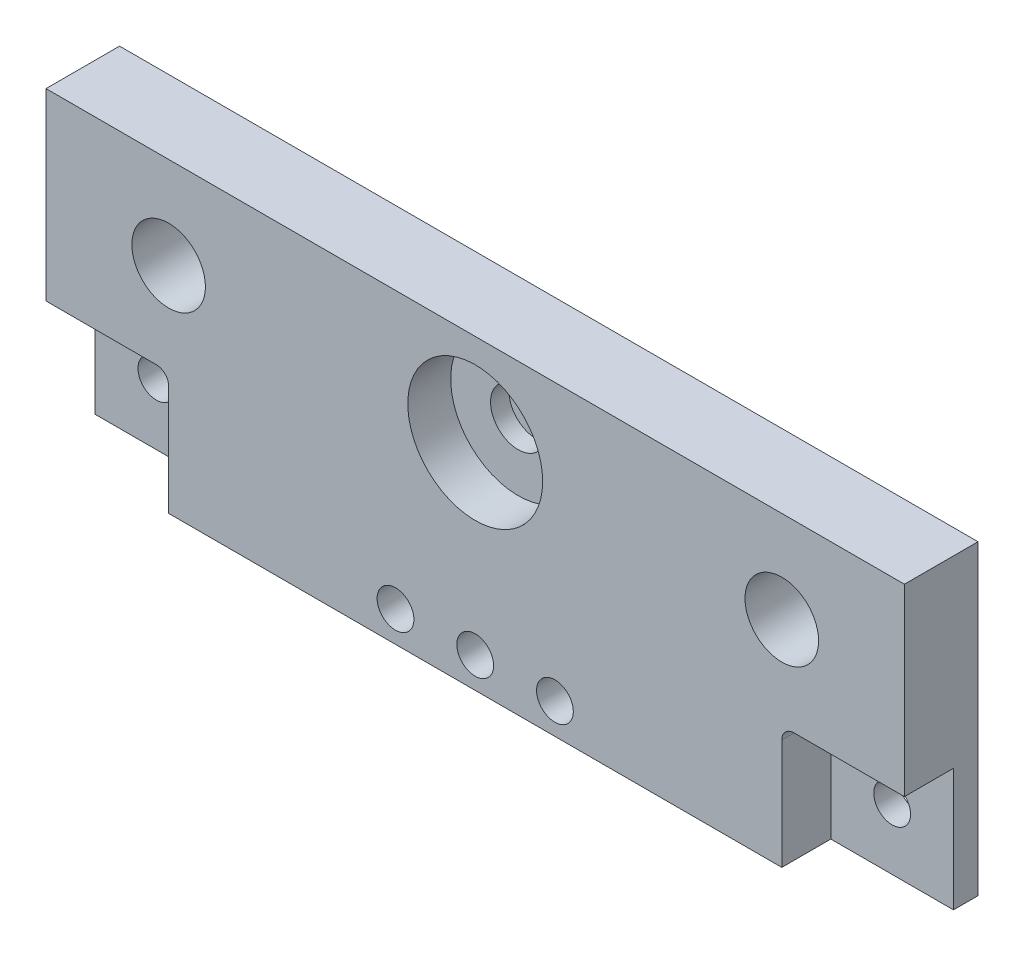
ISO-10303-21;
HEADER;
FILE_DESCRIPTION(('STEP AP214'),'2;1');
FILE_NAME('part.step','',(''),(''),'','','');
FILE_SCHEMA(('AUTOMOTIVE_DESIGN { 1 0 10303 214 1 1 1 1 }'));
ENDSEC;
DATA;
#1=APPLICATION_CONTEXT('core data for automotive mechanical design processes');
#2=APPLICATION_PROTOCOL_DEFINITION('international standard','automotive_design',2000,#1);
#3=PRODUCT_CONTEXT('',#1,'mechanical');
#4=PRODUCT('Part','Part','',(#3));
#5=PRODUCT_RELATED_PRODUCT_CATEGORY('part','',(#4));
#6=PRODUCT_DEFINITION_FORMATION('','',#4);
#7=PRODUCT_DEFINITION_CONTEXT('part definition',#1,'design');
#8=PRODUCT_DEFINITION('design','',#6,#7);
#9=PRODUCT_DEFINITION_SHAPE('','',#8);
#10=(LENGTH_UNIT() NAMED_UNIT(*) SI_UNIT(.MILLI.,.METRE.));
#11=(NAMED_UNIT(*) PLANE_ANGLE_UNIT() SI_UNIT($,.RADIAN.));
#12=(NAMED_UNIT(*) SI_UNIT($,.STERADIAN.) SOLID_ANGLE_UNIT());
#13=UNCERTAINTY_MEASURE_WITH_UNIT(LENGTH_MEASURE(1.E-05),#10,'distance_accuracy_value','');
#14=(GEOMETRIC_REPRESENTATION_CONTEXT(3) GLOBAL_UNCERTAINTY_ASSIGNED_CONTEXT((#13)) GLOBAL_UNIT_ASSIGNED_CONTEXT((#10,
#11,#12)) REPRESENTATION_CONTEXT('',''));
#15=CARTESIAN_POINT('',(0.,0.,0.));
#16=DIRECTION('',(0.,0.,1.));
#17=DIRECTION('',(1.,0.,0.));
#18=AXIS2_PLACEMENT_3D('',#15,#16,#17);
#19=CARTESIAN_POINT('',(-60.0436585898276,-43.0813250382013,8.));
#20=DIRECTION('',(0.,1.,0.));
#21=DIRECTION('',(0.,0.,1.));
#22=AXIS2_PLACEMENT_3D('',#19,#20,#21);
#23=PLANE('',#22);
#24=DIRECTION('',(1.,0.,0.));
#25=VECTOR('',#24,1.);
#26=CARTESIAN_POINT('',(-60.0436585898276,-43.0813250382013,0.));
#27=LINE('',#26,#25);
#28=CARTESIAN_POINT('',(-60.0436585898276,-43.0813250382013,0.));
#29=VERTEX_POINT('',#28);
#30=CARTESIAN_POINT('',(-42.0436585898276,-43.0813250382013,0.));
#31=VERTEX_POINT('',#30);
#32=EDGE_CURVE('E217',#29,#31,#27,.T.);
#33=ORIENTED_EDGE('',*,*,#32,.T.);
#34=DIRECTION('',(0.,0.,-1.));
#35=VECTOR('',#34,1.);
#36=CARTESIAN_POINT('',(-42.0436585898276,-43.0813250382013,8.));
#37=LINE('',#36,#35);
#38=CARTESIAN_POINT('',(-42.0436585898276,-43.0813250382013,8.));
#39=VERTEX_POINT('',#38);
#40=EDGE_CURVE('E241',#31,#39,#37,.F.);
#41=ORIENTED_EDGE('',*,*,#40,.T.);
#42=DIRECTION('',(1.,0.,0.));
#43=VECTOR('',#42,1.);
#44=CARTESIAN_POINT('',(-60.0436585898276,-43.0813250382013,8.));
#45=LINE('',#44,#43);
#46=CARTESIAN_POINT('',(-60.0436585898276,-43.0813250382013,8.));
#47=VERTEX_POINT('',#46);
#48=EDGE_CURVE('E218',#47,#39,#45,.T.);
#49=ORIENTED_EDGE('',*,*,#48,.F.);
#50=DIRECTION('',(0.,0.,-1.));
#51=VECTOR('',#50,1.);
#52=CARTESIAN_POINT('',(-60.0436585898276,-43.0813250382013,8.));
#53=LINE('',#52,#51);
#54=EDGE_CURVE('E256',#47,#29,#53,.T.);
#55=ORIENTED_EDGE('',*,*,#54,.T.);
#56=EDGE_LOOP('',(#33,#41,#49,#55));
#57=FACE_BOUND('',#56,.T.);
#58=ADVANCED_FACE('F34',(#57),#23,.F.);
#59=CARTESIAN_POINT('',(61.9563414101724,-43.0813250382013,8.));
#60=VERTEX_POINT('',#59);
#61=CARTESIAN_POINT('',(79.9563414101724,-43.0813250382013,8.));
#62=VERTEX_POINT('',#61);
#63=EDGE_CURVE('E216',#60,#62,#45,.T.);
#64=ORIENTED_EDGE('',*,*,#63,.F.);
#65=DIRECTION('',(0.,0.,-1.));
#66=VECTOR('',#65,1.);
#67=CARTESIAN_POINT('',(61.9563414101724,-43.0813250382013,0.));
#68=LINE('',#67,#66);
#69=CARTESIAN_POINT('',(61.9563414101724,-43.0813250382013,0.));
#70=VERTEX_POINT('',#69);
#71=EDGE_CURVE('E235',#60,#70,#68,.T.);
#72=ORIENTED_EDGE('',*,*,#71,.T.);
#73=CARTESIAN_POINT('',(79.9563414101724,-43.0813250382013,0.));
#74=VERTEX_POINT('',#73);
#75=EDGE_CURVE('E211',#70,#74,#27,.T.);
#76=ORIENTED_EDGE('',*,*,#75,.T.);
#77=DIRECTION('',(0.,0.,-1.));
#78=VECTOR('',#77,1.);
#79=CARTESIAN_POINT('',(79.9563414101724,-43.0813250382013,8.));
#80=LINE('',#79,#78);
#81=EDGE_CURVE('E261',#62,#74,#80,.T.);
#82=ORIENTED_EDGE('',*,*,#81,.F.);
#83=EDGE_LOOP('',(#64,#72,#76,#82));
#84=FACE_BOUND('',#83,.T.);
#85=ADVANCED_FACE('F294',(#84),#23,.F.);
#86=CARTESIAN_POINT('',(0.,0.,0.));
#87=DIRECTION('',(0.,0.,-1.));
#88=DIRECTION('',(-1.,0.,0.));
#89=AXIS2_PLACEMENT_3D('',#86,#87,#88);
#90=PLANE('',#89);
#91=CARTESIAN_POINT('',(-50.0436585898276,-53.0813250382013,0.));
#92=DIRECTION('',(0.,0.,-1.));
#93=DIRECTION('',(-1.,0.,0.));
#94=AXIS2_PLACEMENT_3D('',#91,#92,#93);
#95=CIRCLE('',#94,3.);
#96=CARTESIAN_POINT('',(-53.0436585898276,-53.0813250382013,0.));
#97=VERTEX_POINT('',#96);
#98=EDGE_CURVE('E153',#97,#97,#95,.T.);
#99=ORIENTED_EDGE('',*,*,#98,.T.);
#100=EDGE_LOOP('',(#99));
#101=FACE_BOUND('',#100,.T.);
#102=DIRECTION('',(0.,-1.,0.));
#103=VECTOR('',#102,1.);
#104=CARTESIAN_POINT('',(-40.0436585898276,-43.0813250382013,0.));
#105=LINE('',#104,#103);
#106=CARTESIAN_POINT('',(-40.0436585898276,-45.0813250382013,0.));
#107=VERTEX_POINT('',#106);
#108=CARTESIAN_POINT('',(-40.0436585898276,-63.0813250382013,0.));
#109=VERTEX_POINT('',#108);
#110=EDGE_CURVE('E149',#107,#109,#105,.T.);
#111=ORIENTED_EDGE('',*,*,#110,.F.);
#112=CARTESIAN_POINT('',(-42.0436585898276,-45.0813250382013,0.));
#113=DIRECTION('',(0.,0.,-1.));
#114=DIRECTION('',(-1.,0.,0.));
#115=AXIS2_PLACEMENT_3D('',#112,#113,#114);
#116=CIRCLE('',#115,2.);
#117=EDGE_CURVE('E242',#107,#31,#116,.F.);
#118=ORIENTED_EDGE('',*,*,#117,.T.);
#119=ORIENTED_EDGE('',*,*,#32,.F.);
#120=DIRECTION('',(0.,1.,0.));
#121=VECTOR('',#120,1.);
#122=CARTESIAN_POINT('',(-60.0436585898276,-13.0813250382013,0.));
#123=LINE('',#122,#121);
#124=CARTESIAN_POINT('',(-60.0436585898276,-63.0813250382013,0.));
#125=VERTEX_POINT('',#124);
#126=EDGE_CURVE('E171',#125,#29,#123,.T.);
#127=ORIENTED_EDGE('',*,*,#126,.F.);
#128=DIRECTION('',(-1.,0.,0.));
#129=VECTOR('',#128,1.);
#130=CARTESIAN_POINT('',(79.9563414101724,-63.0813250382013,0.));
#131=LINE('',#130,#129);
#132=EDGE_CURVE('E187',#109,#125,#131,.T.);
#133=ORIENTED_EDGE('',*,*,#132,.F.);
#134=EDGE_LOOP('',(#111,#118,#119,#127,#133));
#135=FACE_BOUND('',#134,.T.);
#136=ADVANCED_FACE('F301',(#101,#135),#90,.F.);
#137=CARTESIAN_POINT('',(69.9563414101724,-53.0813250382013,0.));
#138=DIRECTION('',(0.,0.,-1.));
#139=DIRECTION('',(-1.,0.,0.));
#140=AXIS2_PLACEMENT_3D('',#137,#138,#139);
#141=CIRCLE('',#140,3.00000000000001);
#142=CARTESIAN_POINT('',(66.9563414101724,-53.0813250382013,0.));
#143=VERTEX_POINT('',#142);
#144=EDGE_CURVE('E163',#143,#143,#141,.T.);
#145=ORIENTED_EDGE('',*,*,#144,.T.);
#146=EDGE_LOOP('',(#145));
#147=FACE_BOUND('',#146,.T.);
#148=ORIENTED_EDGE('',*,*,#75,.F.);
#149=CARTESIAN_POINT('',(61.9563414101724,-45.0813250382013,0.));
#150=DIRECTION('',(0.,0.,-1.));
#151=DIRECTION('',(-1.,0.,0.));
#152=AXIS2_PLACEMENT_3D('',#149,#150,#151);
#153=CIRCLE('',#152,2.);
#154=CARTESIAN_POINT('',(59.9563414101724,-45.0813250382013,0.));
#155=VERTEX_POINT('',#154);
#156=EDGE_CURVE('E56',#70,#155,#153,.F.);
#157=ORIENTED_EDGE('',*,*,#156,.T.);
#158=DIRECTION('',(0.,1.,0.));
#159=VECTOR('',#158,1.);
#160=CARTESIAN_POINT('',(59.9563414101724,-43.0813250382013,0.));
#161=LINE('',#160,#159);
#162=CARTESIAN_POINT('',(59.9563414101724,-63.0813250382013,0.));
#163=VERTEX_POINT('',#162);
#164=EDGE_CURVE('E136',#163,#155,#161,.T.);
#165=ORIENTED_EDGE('',*,*,#164,.F.);
#166=CARTESIAN_POINT('',(79.9563414101724,-63.0813250382013,0.));
#167=VERTEX_POINT('',#166);
#168=EDGE_CURVE('E182',#167,#163,#131,.T.);
#169=ORIENTED_EDGE('',*,*,#168,.F.);
#170=DIRECTION('',(0.,-1.,0.));
#171=VECTOR('',#170,1.);
#172=CARTESIAN_POINT('',(79.9563414101724,-13.0813250382013,0.));
#173=LINE('',#172,#171);
#174=EDGE_CURVE('E166',#74,#167,#173,.T.);
#175=ORIENTED_EDGE('',*,*,#174,.F.);
#176=EDGE_LOOP('',(#148,#157,#165,#169,#175));
#177=FACE_BOUND('',#176,.T.);
#178=ADVANCED_FACE('F354',(#147,#177),#90,.F.);
#179=CARTESIAN_POINT('',(-60.0436585898276,-43.0813250382013,8.));
#180=DIRECTION('',(0.,0.,1.));
#181=DIRECTION('',(1.,0.,0.));
#182=AXIS2_PLACEMENT_3D('',#179,#180,#181);
#183=PLANE('',#182);
#184=CARTESIAN_POINT('',(9.95634141017243,-58.0813250382013,8.));
#185=DIRECTION('',(0.,0.,1.));
#186=DIRECTION('',(1.,0.,0.));
#187=AXIS2_PLACEMENT_3D('',#184,#185,#186);
#188=CIRCLE('',#187,3.);
#189=CARTESIAN_POINT('',(12.9563414101724,-58.0813250382013,8.));
#190=VERTEX_POINT('',#189);
#191=EDGE_CURVE('E342',#190,#190,#188,.T.);
#192=ORIENTED_EDGE('',*,*,#191,.F.);
#193=EDGE_LOOP('',(#192));
#194=FACE_BOUND('',#193,.T.);
#195=CARTESIAN_POINT('',(-3.04365858982756,-58.0813250382013,8.));
#196=DIRECTION('',(0.,0.,1.));
#197=DIRECTION('',(1.,0.,0.));
#198=AXIS2_PLACEMENT_3D('',#195,#196,#197);
#199=CIRCLE('',#198,3.);
#200=CARTESIAN_POINT('',(-0.0436585898275521,-58.0813250382013,8.));
#201=VERTEX_POINT('',#200);
#202=EDGE_CURVE('E327',#201,#201,#199,.T.);
#203=ORIENTED_EDGE('',*,*,#202,.F.);
#204=EDGE_LOOP('',(#203));
#205=FACE_BOUND('',#204,.T.);
#206=CARTESIAN_POINT('',(22.9563414101724,-58.0813250382013,8.));
#207=DIRECTION('',(0.,0.,1.));
#208=DIRECTION('',(1.,0.,0.));
#209=AXIS2_PLACEMENT_3D('',#206,#207,#208);
#210=CIRCLE('',#209,3.);
#211=CARTESIAN_POINT('',(25.9563414101724,-58.0813250382013,8.));
#212=VERTEX_POINT('',#211);
#213=EDGE_CURVE('E320',#212,#212,#210,.T.);
#214=ORIENTED_EDGE('',*,*,#213,.F.);
#215=EDGE_LOOP('',(#214));
#216=FACE_BOUND('',#215,.T.);
#217=CARTESIAN_POINT('',(-40.0436585898276,-28.0813250382013,8.));
#218=DIRECTION('',(0.,0.,1.));
#219=DIRECTION('',(1.,0.,0.));
#220=AXIS2_PLACEMENT_3D('',#217,#218,#219);
#221=CIRCLE('',#220,6.);
#222=CARTESIAN_POINT('',(-34.0436585898276,-28.0813250382013,8.));
#223=VERTEX_POINT('',#222);
#224=EDGE_CURVE('E203',#223,#223,#221,.T.);
#225=ORIENTED_EDGE('',*,*,#224,.F.);
#226=EDGE_LOOP('',(#225));
#227=FACE_BOUND('',#226,.T.);
#228=DIRECTION('',(0.,-1.,0.));
#229=VECTOR('',#228,1.);
#230=CARTESIAN_POINT('',(-60.0436585898276,-13.0813250382013,8.));
#231=LINE('',#230,#229);
#232=CARTESIAN_POINT('',(-60.0436585898276,-13.0813250382013,8.));
#233=VERTEX_POINT('',#232);
#234=EDGE_CURVE('E214',#233,#47,#231,.T.);
#235=ORIENTED_EDGE('',*,*,#234,.T.);
#236=ORIENTED_EDGE('',*,*,#48,.T.);
#237=CARTESIAN_POINT('',(-42.0436585898276,-45.0813250382013,8.));
#238=DIRECTION('',(0.,0.,1.));
#239=DIRECTION('',(1.,0.,0.));
#240=AXIS2_PLACEMENT_3D('',#237,#238,#239);
#241=CIRCLE('',#240,2.);
#242=CARTESIAN_POINT('',(-40.0436585898276,-45.0813250382013,8.));
#243=VERTEX_POINT('',#242);
#244=EDGE_CURVE('E131',#39,#243,#241,.F.);
#245=ORIENTED_EDGE('',*,*,#244,.T.);
#246=DIRECTION('',(0.,-1.,0.));
#247=VECTOR('',#246,1.);
#248=CARTESIAN_POINT('',(-40.0436585898276,-43.0813250382013,8.));
#249=LINE('',#248,#247);
#250=CARTESIAN_POINT('',(-40.0436585898276,-63.0813250382013,8.));
#251=VERTEX_POINT('',#250);
#252=EDGE_CURVE('E122',#243,#251,#249,.T.);
#253=ORIENTED_EDGE('',*,*,#252,.T.);
#254=DIRECTION('',(1.,0.,0.));
#255=VECTOR('',#254,1.);
#256=CARTESIAN_POINT('',(-40.0436585898276,-63.0813250382013,8.));
#257=LINE('',#256,#255);
#258=CARTESIAN_POINT('',(59.9563414101724,-63.0813250382013,8.));
#259=VERTEX_POINT('',#258);
#260=EDGE_CURVE('E127',#251,#259,#257,.T.);
#261=ORIENTED_EDGE('',*,*,#260,.T.);
#262=DIRECTION('',(0.,1.,0.));
#263=VECTOR('',#262,1.);
#264=CARTESIAN_POINT('',(59.9563414101724,-43.0813250382013,8.));
#265=LINE('',#264,#263);
#266=CARTESIAN_POINT('',(59.9563414101724,-45.0813250382013,8.));
#267=VERTEX_POINT('',#266);
#268=EDGE_CURVE('E145',#259,#267,#265,.T.);
#269=ORIENTED_EDGE('',*,*,#268,.T.);
#270=CARTESIAN_POINT('',(61.9563414101724,-45.0813250382013,8.));
#271=DIRECTION('',(0.,0.,1.));
#272=DIRECTION('',(1.,0.,0.));
#273=AXIS2_PLACEMENT_3D('',#270,#271,#272);
#274=CIRCLE('',#273,2.);
#275=EDGE_CURVE('E11',#267,#60,#274,.F.);
#276=ORIENTED_EDGE('',*,*,#275,.T.);
#277=ORIENTED_EDGE('',*,*,#63,.T.);
#278=DIRECTION('',(0.,1.,0.));
#279=VECTOR('',#278,1.);
#280=CARTESIAN_POINT('',(79.9563414101724,-13.0813250382013,8.));
#281=LINE('',#280,#279);
#282=CARTESIAN_POINT('',(79.9563414101724,-13.0813250382013,8.));
#283=VERTEX_POINT('',#282);
#284=EDGE_CURVE('E220',#62,#283,#281,.T.);
#285=ORIENTED_EDGE('',*,*,#284,.T.);
#286=DIRECTION('',(-1.,0.,0.));
#287=VECTOR('',#286,1.);
#288=CARTESIAN_POINT('',(-60.0436585898276,-13.0813250382013,8.));
#289=LINE('',#288,#287);
#290=EDGE_CURVE('E222',#283,#233,#289,.T.);
#291=ORIENTED_EDGE('',*,*,#290,.T.);
#292=EDGE_LOOP('',(#235,#236,#245,#253,#261,#269,#276,#277,#285,#291));
#293=FACE_BOUND('',#292,.T.);
#294=CARTESIAN_POINT('',(9.95634141017245,-28.0813250382013,8.));
#295=DIRECTION('',(0.,0.,1.));
#296=DIRECTION('',(1.,0.,0.));
#297=AXIS2_PLACEMENT_3D('',#294,#295,#296);
#298=CIRCLE('',#297,11.);
#299=CARTESIAN_POINT('',(20.9563414101724,-28.0813250382013,8.));
#300=VERTEX_POINT('',#299);
#301=EDGE_CURVE('E207',#300,#300,#298,.T.);
#302=ORIENTED_EDGE('',*,*,#301,.F.);
#303=EDGE_LOOP('',(#302));
#304=FACE_BOUND('',#303,.T.);
#305=CARTESIAN_POINT('',(59.9563414101724,-28.0813250382013,8.));
#306=DIRECTION('',(0.,0.,1.));
#307=DIRECTION('',(1.,0.,0.));
#308=AXIS2_PLACEMENT_3D('',#305,#306,#307);
#309=CIRCLE('',#308,6.);
#310=CARTESIAN_POINT('',(65.9563414101725,-28.0813250382013,8.));
#311=VERTEX_POINT('',#310);
#312=EDGE_CURVE('E192',#311,#311,#309,.T.);
#313=ORIENTED_EDGE('',*,*,#312,.F.);
#314=EDGE_LOOP('',(#313));
#315=FACE_BOUND('',#314,.T.);
#316=ADVANCED_FACE('F125',(#194,#205,#216,#227,#293,#304,#315),#183,.T.);
#317=CARTESIAN_POINT('',(-60.0436585898276,-13.0813250382013,8.));
#318=DIRECTION('',(1.,0.,0.));
#319=DIRECTION('',(0.,1.,0.));
#320=AXIS2_PLACEMENT_3D('',#317,#318,#319);
#321=PLANE('',#320);
#322=DIRECTION('',(0.,0.,-1.));
#323=VECTOR('',#322,1.);
#324=CARTESIAN_POINT('',(-60.0436585898276,-13.0813250382013,8.));
#325=LINE('',#324,#323);
#326=CARTESIAN_POINT('',(-60.0436585898276,-13.0813250382013,-4.));
#327=VERTEX_POINT('',#326);
#328=EDGE_CURVE('E224',#233,#327,#325,.T.);
#329=ORIENTED_EDGE('',*,*,#328,.T.);
#330=DIRECTION('',(0.,1.,0.));
#331=VECTOR('',#330,1.);
#332=CARTESIAN_POINT('',(-60.0436585898276,-13.0813250382013,-4.));
#333=LINE('',#332,#331);
#334=CARTESIAN_POINT('',(-60.0436585898276,-63.0813250382013,-4.));
#335=VERTEX_POINT('',#334);
#336=EDGE_CURVE('E173',#335,#327,#333,.T.);
#337=ORIENTED_EDGE('',*,*,#336,.F.);
#338=DIRECTION('',(0.,0.,1.));
#339=VECTOR('',#338,1.);
#340=CARTESIAN_POINT('',(-60.0436585898276,-63.0813250382013,-4.));
#341=LINE('',#340,#339);
#342=EDGE_CURVE('E179',#335,#125,#341,.T.);
#343=ORIENTED_EDGE('',*,*,#342,.T.);
#344=ORIENTED_EDGE('',*,*,#126,.T.);
#345=ORIENTED_EDGE('',*,*,#54,.F.);
#346=ORIENTED_EDGE('',*,*,#234,.F.);
#347=EDGE_LOOP('',(#329,#337,#343,#344,#345,#346));
#348=FACE_BOUND('',#347,.T.);
#349=ADVANCED_FACE('F274',(#348),#321,.F.);
#350=CARTESIAN_POINT('',(79.9563414101724,-13.0813250382013,8.));
#351=DIRECTION('',(-1.,0.,0.));
#352=DIRECTION('',(0.,0.,1.));
#353=AXIS2_PLACEMENT_3D('',#350,#351,#352);
#354=PLANE('',#353);
#355=ORIENTED_EDGE('',*,*,#81,.T.);
#356=ORIENTED_EDGE('',*,*,#174,.T.);
#357=DIRECTION('',(0.,0.,1.));
#358=VECTOR('',#357,1.);
#359=CARTESIAN_POINT('',(79.9563414101724,-63.0813250382013,-4.));
#360=LINE('',#359,#358);
#361=CARTESIAN_POINT('',(79.9563414101724,-63.0813250382013,-4.));
#362=VERTEX_POINT('',#361);
#363=EDGE_CURVE('E188',#362,#167,#360,.T.);
#364=ORIENTED_EDGE('',*,*,#363,.F.);
#365=DIRECTION('',(0.,-1.,0.));
#366=VECTOR('',#365,1.);
#367=CARTESIAN_POINT('',(79.9563414101724,-13.0813250382013,-4.));
#368=LINE('',#367,#366);
#369=CARTESIAN_POINT('',(79.9563414101724,-13.0813250382013,-4.));
#370=VERTEX_POINT('',#369);
#371=EDGE_CURVE('E167',#370,#362,#368,.T.);
#372=ORIENTED_EDGE('',*,*,#371,.F.);
#373=DIRECTION('',(0.,0.,-1.));
#374=VECTOR('',#373,1.);
#375=CARTESIAN_POINT('',(79.9563414101724,-13.0813250382013,8.));
#376=LINE('',#375,#374);
#377=EDGE_CURVE('E264',#283,#370,#376,.T.);
#378=ORIENTED_EDGE('',*,*,#377,.F.);
#379=ORIENTED_EDGE('',*,*,#284,.F.);
#380=EDGE_LOOP('',(#355,#356,#364,#372,#378,#379));
#381=FACE_BOUND('',#380,.T.);
#382=ADVANCED_FACE('F282',(#381),#354,.F.);
#383=CARTESIAN_POINT('',(-60.0436585898276,-13.0813250382013,8.));
#384=DIRECTION('',(0.,-1.,0.));
#385=DIRECTION('',(0.,0.,-1.));
#386=AXIS2_PLACEMENT_3D('',#383,#384,#385);
#387=PLANE('',#386);
#388=ORIENTED_EDGE('',*,*,#377,.T.);
#389=DIRECTION('',(1.,0.,0.));
#390=VECTOR('',#389,1.);
#391=CARTESIAN_POINT('',(79.9563414101724,-13.0813250382013,-4.));
#392=LINE('',#391,#390);
#393=EDGE_CURVE('E176',#327,#370,#392,.T.);
#394=ORIENTED_EDGE('',*,*,#393,.F.);
#395=ORIENTED_EDGE('',*,*,#328,.F.);
#396=ORIENTED_EDGE('',*,*,#290,.F.);
#397=EDGE_LOOP('',(#388,#394,#395,#396));
#398=FACE_BOUND('',#397,.T.);
#399=ADVANCED_FACE('F279',(#398),#387,.F.);
#400=CARTESIAN_POINT('',(9.95634141017245,-28.0813250382013,8.));
#401=DIRECTION('',(0.,0.,-1.));
#402=DIRECTION('',(-1.,0.,0.));
#403=AXIS2_PLACEMENT_3D('',#400,#401,#402);
#404=CYLINDRICAL_SURFACE('',#403,11.);
#405=CARTESIAN_POINT('',(9.95634141017245,-28.0813250382013,1.));
#406=DIRECTION('',(0.,0.,1.));
#407=DIRECTION('',(1.,0.,0.));
#408=AXIS2_PLACEMENT_3D('',#405,#406,#407);
#409=CIRCLE('',#408,11.);
#410=CARTESIAN_POINT('',(20.9563414101724,-28.0813250382013,1.));
#411=VERTEX_POINT('',#410);
#412=EDGE_CURVE('E250',#411,#411,#409,.T.);
#413=ORIENTED_EDGE('',*,*,#412,.F.);
#414=EDGE_LOOP('',(#413));
#415=FACE_BOUND('',#414,.T.);
#416=ORIENTED_EDGE('',*,*,#301,.T.);
#417=EDGE_LOOP('',(#416));
#418=FACE_BOUND('',#417,.T.);
#419=ADVANCED_FACE('F281',(#415,#418),#404,.F.);
#420=CARTESIAN_POINT('',(-40.0436585898276,-28.0813250382013,8.));
#421=DIRECTION('',(0.,0.,-1.));
#422=DIRECTION('',(-1.,0.,0.));
#423=AXIS2_PLACEMENT_3D('',#420,#421,#422);
#424=CYLINDRICAL_SURFACE('',#423,6.);
#425=ORIENTED_EDGE('',*,*,#224,.T.);
#426=EDGE_LOOP('',(#425));
#427=FACE_BOUND('',#426,.T.);
#428=CARTESIAN_POINT('',(-40.0436585898276,-28.0813250382013,-2.));
#429=DIRECTION('',(0.,0.,1.));
#430=DIRECTION('',(1.,0.,0.));
#431=AXIS2_PLACEMENT_3D('',#428,#429,#430);
#432=CIRCLE('',#431,6.00000000000001);
#433=CARTESIAN_POINT('',(-34.0436585898276,-28.0813250382013,-2.));
#434=VERTEX_POINT('',#433);
#435=EDGE_CURVE('E330',#434,#434,#432,.T.);
#436=ORIENTED_EDGE('',*,*,#435,.F.);
#437=EDGE_LOOP('',(#436));
#438=FACE_BOUND('',#437,.T.);
#439=ADVANCED_FACE('F288',(#427,#438),#424,.F.);
#440=CARTESIAN_POINT('',(59.9563414101724,-28.0813250382013,8.));
#441=DIRECTION('',(0.,0.,-1.));
#442=DIRECTION('',(-1.,0.,0.));
#443=AXIS2_PLACEMENT_3D('',#440,#441,#442);
#444=CYLINDRICAL_SURFACE('',#443,6.);
#445=ORIENTED_EDGE('',*,*,#312,.T.);
#446=EDGE_LOOP('',(#445));
#447=FACE_BOUND('',#446,.T.);
#448=CARTESIAN_POINT('',(59.9563414101724,-28.0813250382013,-2.));
#449=DIRECTION('',(0.,0.,1.));
#450=DIRECTION('',(1.,0.,0.));
#451=AXIS2_PLACEMENT_3D('',#448,#449,#450);
#452=CIRCLE('',#451,6.);
#453=CARTESIAN_POINT('',(65.9563414101725,-28.0813250382013,-2.));
#454=VERTEX_POINT('',#453);
#455=EDGE_CURVE('E335',#454,#454,#452,.T.);
#456=ORIENTED_EDGE('',*,*,#455,.F.);
#457=EDGE_LOOP('',(#456));
#458=FACE_BOUND('',#457,.T.);
#459=ADVANCED_FACE('F394',(#447,#458),#444,.F.);
#460=CARTESIAN_POINT('',(0.,0.,-4.));
#461=DIRECTION('',(0.,0.,-1.));
#462=DIRECTION('',(-1.,0.,0.));
#463=AXIS2_PLACEMENT_3D('',#460,#461,#462);
#464=PLANE('',#463);
#465=CARTESIAN_POINT('',(9.95634141017243,-58.0813250382013,-4.));
#466=DIRECTION('',(0.,0.,1.));
#467=DIRECTION('',(1.,0.,0.));
#468=AXIS2_PLACEMENT_3D('',#465,#466,#467);
#469=CIRCLE('',#468,3.);
#470=CARTESIAN_POINT('',(12.9563414101724,-58.0813250382013,-4.));
#471=VERTEX_POINT('',#470);
#472=EDGE_CURVE('E341',#471,#471,#469,.T.);
#473=ORIENTED_EDGE('',*,*,#472,.T.);
#474=EDGE_LOOP('',(#473));
#475=FACE_BOUND('',#474,.T.);
#476=CARTESIAN_POINT('',(-50.0436585898276,-53.0813250382013,-4.));
#477=DIRECTION('',(0.,0.,-1.));
#478=DIRECTION('',(-1.,0.,0.));
#479=AXIS2_PLACEMENT_3D('',#476,#477,#478);
#480=CIRCLE('',#479,3.);
#481=CARTESIAN_POINT('',(-53.0436585898276,-53.0813250382013,-4.));
#482=VERTEX_POINT('',#481);
#483=EDGE_CURVE('E150',#482,#482,#480,.T.);
#484=ORIENTED_EDGE('',*,*,#483,.F.);
#485=EDGE_LOOP('',(#484));
#486=FACE_BOUND('',#485,.T.);
#487=CARTESIAN_POINT('',(69.9563414101724,-53.0813250382013,-4.));
#488=DIRECTION('',(0.,0.,-1.));
#489=DIRECTION('',(-1.,0.,0.));
#490=AXIS2_PLACEMENT_3D('',#487,#488,#489);
#491=CIRCLE('',#490,3.00000000000001);
#492=CARTESIAN_POINT('',(66.9563414101724,-53.0813250382013,-4.));
#493=VERTEX_POINT('',#492);
#494=EDGE_CURVE('E160',#493,#493,#491,.T.);
#495=ORIENTED_EDGE('',*,*,#494,.F.);
#496=EDGE_LOOP('',(#495));
#497=FACE_BOUND('',#496,.T.);
#498=ORIENTED_EDGE('',*,*,#371,.T.);
#499=DIRECTION('',(-1.,0.,0.));
#500=VECTOR('',#499,1.);
#501=CARTESIAN_POINT('',(79.9563414101724,-63.0813250382013,-4.));
#502=LINE('',#501,#500);
#503=EDGE_CURVE('E170',#362,#335,#502,.T.);
#504=ORIENTED_EDGE('',*,*,#503,.T.);
#505=ORIENTED_EDGE('',*,*,#336,.T.);
#506=ORIENTED_EDGE('',*,*,#393,.T.);
#507=EDGE_LOOP('',(#498,#504,#505,#506));
#508=FACE_BOUND('',#507,.T.);
#509=ADVANCED_FACE('F277',(#475,#486,#497,#508),#464,.T.);
#510=CARTESIAN_POINT('',(79.9563414101724,-63.0813250382013,-4.));
#511=DIRECTION('',(0.,1.,0.));
#512=DIRECTION('',(0.,0.,1.));
#513=AXIS2_PLACEMENT_3D('',#510,#511,#512);
#514=PLANE('',#513);
#515=ORIENTED_EDGE('',*,*,#168,.T.);
#516=DIRECTION('',(0.,0.,-1.));
#517=VECTOR('',#516,1.);
#518=CARTESIAN_POINT('',(59.9563414101724,-63.0813250382013,8.));
#519=LINE('',#518,#517);
#520=EDGE_CURVE('E144',#259,#163,#519,.T.);
#521=ORIENTED_EDGE('',*,*,#520,.F.);
#522=ORIENTED_EDGE('',*,*,#260,.F.);
#523=DIRECTION('',(0.,0.,-1.));
#524=VECTOR('',#523,1.);
#525=CARTESIAN_POINT('',(-40.0436585898276,-63.0813250382013,8.));
#526=LINE('',#525,#524);
#527=EDGE_CURVE('E142',#251,#109,#526,.T.);
#528=ORIENTED_EDGE('',*,*,#527,.T.);
#529=ORIENTED_EDGE('',*,*,#132,.T.);
#530=ORIENTED_EDGE('',*,*,#342,.F.);
#531=ORIENTED_EDGE('',*,*,#503,.F.);
#532=ORIENTED_EDGE('',*,*,#363,.T.);
#533=EDGE_LOOP('',(#515,#521,#522,#528,#529,#530,#531,#532));
#534=FACE_BOUND('',#533,.T.);
#535=ADVANCED_FACE('F141',(#534),#514,.F.);
#536=CARTESIAN_POINT('',(69.9563414101724,-53.0813250382013,8.000025));
#537=DIRECTION('',(0.,0.,-1.));
#538=DIRECTION('',(-1.,0.,0.));
#539=AXIS2_PLACEMENT_3D('',#536,#537,#538);
#540=CYLINDRICAL_SURFACE('',#539,3.00000000000001);
#541=ORIENTED_EDGE('',*,*,#494,.T.);
#542=EDGE_LOOP('',(#541));
#543=FACE_BOUND('',#542,.T.);
#544=ORIENTED_EDGE('',*,*,#144,.F.);
#545=EDGE_LOOP('',(#544));
#546=FACE_BOUND('',#545,.T.);
#547=ADVANCED_FACE('F387',(#543,#546),#540,.F.);
#548=CARTESIAN_POINT('',(-50.0436585898276,-53.0813250382013,8.000025));
#549=DIRECTION('',(0.,0.,-1.));
#550=DIRECTION('',(-1.,0.,0.));
#551=AXIS2_PLACEMENT_3D('',#548,#549,#550);
#552=CYLINDRICAL_SURFACE('',#551,3.);
#553=ORIENTED_EDGE('',*,*,#483,.T.);
#554=EDGE_LOOP('',(#553));
#555=FACE_BOUND('',#554,.T.);
#556=ORIENTED_EDGE('',*,*,#98,.F.);
#557=EDGE_LOOP('',(#556));
#558=FACE_BOUND('',#557,.T.);
#559=ADVANCED_FACE('F380',(#555,#558),#552,.F.);
#560=CARTESIAN_POINT('',(-40.0436585898276,-43.0813250382013,8.));
#561=DIRECTION('',(1.,0.,0.));
#562=DIRECTION('',(0.,0.,-1.));
#563=AXIS2_PLACEMENT_3D('',#560,#561,#562);
#564=PLANE('',#563);
#565=ORIENTED_EDGE('',*,*,#252,.F.);
#566=DIRECTION('',(0.,0.,-1.));
#567=VECTOR('',#566,1.);
#568=CARTESIAN_POINT('',(-40.0436585898276,-45.0813250382013,0.));
#569=LINE('',#568,#567);
#570=EDGE_CURVE('E246',#243,#107,#569,.T.);
#571=ORIENTED_EDGE('',*,*,#570,.T.);
#572=ORIENTED_EDGE('',*,*,#110,.T.);
#573=ORIENTED_EDGE('',*,*,#527,.F.);
#574=EDGE_LOOP('',(#565,#571,#572,#573));
#575=FACE_BOUND('',#574,.T.);
#576=ADVANCED_FACE('F147',(#575),#564,.F.);
#577=CARTESIAN_POINT('',(59.9563414101724,-43.0813250382013,8.));
#578=DIRECTION('',(-1.,0.,0.));
#579=DIRECTION('',(0.,0.,1.));
#580=AXIS2_PLACEMENT_3D('',#577,#578,#579);
#581=PLANE('',#580);
#582=ORIENTED_EDGE('',*,*,#164,.T.);
#583=DIRECTION('',(0.,0.,-1.));
#584=VECTOR('',#583,1.);
#585=CARTESIAN_POINT('',(59.9563414101724,-45.0813250382013,8.));
#586=LINE('',#585,#584);
#587=EDGE_CURVE('E42',#155,#267,#586,.F.);
#588=ORIENTED_EDGE('',*,*,#587,.T.);
#589=ORIENTED_EDGE('',*,*,#268,.F.);
#590=ORIENTED_EDGE('',*,*,#520,.T.);
#591=EDGE_LOOP('',(#582,#588,#589,#590));
#592=FACE_BOUND('',#591,.T.);
#593=ADVANCED_FACE('F363',(#592),#581,.F.);
#594=CARTESIAN_POINT('',(22.9563414101724,-58.0813250382013,0.));
#595=DIRECTION('',(0.,0.,1.));
#596=DIRECTION('',(1.,0.,0.));
#597=AXIS2_PLACEMENT_3D('',#594,#595,#596);
#598=CYLINDRICAL_SURFACE('',#597,3.);
#599=CARTESIAN_POINT('',(22.9563414101724,-58.0813250382013,0.));
#600=DIRECTION('',(0.,0.,1.));
#601=DIRECTION('',(1.,0.,0.));
#602=AXIS2_PLACEMENT_3D('',#599,#600,#601);
#603=CIRCLE('',#602,3.);
#604=CARTESIAN_POINT('',(25.9563414101724,-58.0813250382013,0.));
#605=VERTEX_POINT('',#604);
#606=EDGE_CURVE('E317',#605,#605,#603,.T.);
#607=ORIENTED_EDGE('',*,*,#606,.F.);
#608=EDGE_LOOP('',(#607));
#609=FACE_BOUND('',#608,.T.);
#610=ORIENTED_EDGE('',*,*,#213,.T.);
#611=EDGE_LOOP('',(#610));
#612=FACE_BOUND('',#611,.T.);
#613=ADVANCED_FACE('F360',(#609,#612),#598,.F.);
#614=CARTESIAN_POINT('',(22.9563414101724,-58.0813250382013,0.));
#615=DIRECTION('',(0.,0.,1.));
#616=DIRECTION('',(1.,0.,0.));
#617=AXIS2_PLACEMENT_3D('',#614,#615,#616);
#618=PLANE('',#617);
#619=ORIENTED_EDGE('',*,*,#606,.T.);
#620=EDGE_LOOP('',(#619));
#621=FACE_BOUND('',#620,.T.);
#622=ADVANCED_FACE('F362',(#621),#618,.T.);
#623=CARTESIAN_POINT('',(-3.04365858982756,-58.0813250382013,0.));
#624=DIRECTION('',(0.,0.,1.));
#625=DIRECTION('',(1.,0.,0.));
#626=AXIS2_PLACEMENT_3D('',#623,#624,#625);
#627=CYLINDRICAL_SURFACE('',#626,3.);
#628=CARTESIAN_POINT('',(-3.04365858982756,-58.0813250382013,0.));
#629=DIRECTION('',(0.,0.,1.));
#630=DIRECTION('',(1.,0.,0.));
#631=AXIS2_PLACEMENT_3D('',#628,#629,#630);
#632=CIRCLE('',#631,3.);
#633=CARTESIAN_POINT('',(-0.0436585898275521,-58.0813250382013,0.));
#634=VERTEX_POINT('',#633);
#635=EDGE_CURVE('E325',#634,#634,#632,.T.);
#636=ORIENTED_EDGE('',*,*,#635,.F.);
#637=EDGE_LOOP('',(#636));
#638=FACE_BOUND('',#637,.T.);
#639=ORIENTED_EDGE('',*,*,#202,.T.);
#640=EDGE_LOOP('',(#639));
#641=FACE_BOUND('',#640,.T.);
#642=ADVANCED_FACE('F370',(#638,#641),#627,.F.);
#643=CARTESIAN_POINT('',(-3.04365858982756,-58.0813250382013,0.));
#644=DIRECTION('',(0.,0.,1.));
#645=DIRECTION('',(1.,0.,0.));
#646=AXIS2_PLACEMENT_3D('',#643,#644,#645);
#647=PLANE('',#646);
#648=ORIENTED_EDGE('',*,*,#635,.T.);
#649=EDGE_LOOP('',(#648));
#650=FACE_BOUND('',#649,.T.);
#651=ADVANCED_FACE('F410',(#650),#647,.T.);
#652=CARTESIAN_POINT('',(-40.0436585898276,-28.0813250382013,-2.));
#653=DIRECTION('',(0.,0.,1.));
#654=DIRECTION('',(1.,0.,0.));
#655=AXIS2_PLACEMENT_3D('',#652,#653,#654);
#656=PLANE('',#655);
#657=ORIENTED_EDGE('',*,*,#435,.T.);
#658=EDGE_LOOP('',(#657));
#659=FACE_BOUND('',#658,.T.);
#660=ADVANCED_FACE('F407',(#659),#656,.T.);
#661=CARTESIAN_POINT('',(59.9563414101724,-28.0813250382013,-2.));
#662=DIRECTION('',(0.,0.,1.));
#663=DIRECTION('',(1.,0.,0.));
#664=AXIS2_PLACEMENT_3D('',#661,#662,#663);
#665=PLANE('',#664);
#666=ORIENTED_EDGE('',*,*,#455,.T.);
#667=EDGE_LOOP('',(#666));
#668=FACE_BOUND('',#667,.T.);
#669=ADVANCED_FACE('F409',(#668),#665,.T.);
#670=CARTESIAN_POINT('',(9.95634141017245,-28.0813250382013,1.));
#671=DIRECTION('',(0.,0.,1.));
#672=DIRECTION('',(1.,0.,0.));
#673=AXIS2_PLACEMENT_3D('',#670,#671,#672);
#674=PLANE('',#673);
#675=ORIENTED_EDGE('',*,*,#412,.T.);
#676=EDGE_LOOP('',(#675));
#677=FACE_BOUND('',#676,.T.);
#678=CARTESIAN_POINT('',(9.95634141017245,-28.0813250382013,1.));
#679=DIRECTION('',(0.,0.,1.));
#680=DIRECTION('',(1.,0.,0.));
#681=AXIS2_PLACEMENT_3D('',#678,#679,#680);
#682=CIRCLE('',#681,4.5);
#683=CARTESIAN_POINT('',(14.4563414101724,-28.0813250382013,1.));
#684=VERTEX_POINT('',#683);
#685=EDGE_CURVE('E338',#684,#684,#682,.T.);
#686=ORIENTED_EDGE('',*,*,#685,.F.);
#687=EDGE_LOOP('',(#686));
#688=FACE_BOUND('',#687,.T.);
#689=ADVANCED_FACE('F416',(#677,#688),#674,.T.);
#690=CARTESIAN_POINT('',(9.95634141017245,-28.0813250382013,1.));
#691=DIRECTION('',(0.,0.,-1.));
#692=DIRECTION('',(-1.,0.,0.));
#693=AXIS2_PLACEMENT_3D('',#690,#691,#692);
#694=CYLINDRICAL_SURFACE('',#693,4.5);
#695=ORIENTED_EDGE('',*,*,#685,.T.);
#696=EDGE_LOOP('',(#695));
#697=FACE_BOUND('',#696,.T.);
#698=CARTESIAN_POINT('',(9.95634141017245,-28.0813250382013,-2.));
#699=DIRECTION('',(0.,0.,1.));
#700=DIRECTION('',(1.,0.,0.));
#701=AXIS2_PLACEMENT_3D('',#698,#699,#700);
#702=CIRCLE('',#701,4.5);
#703=CARTESIAN_POINT('',(14.4563414101724,-28.0813250382013,-2.));
#704=VERTEX_POINT('',#703);
#705=EDGE_CURVE('E253',#704,#704,#702,.F.);
#706=ORIENTED_EDGE('',*,*,#705,.T.);
#707=EDGE_LOOP('',(#706));
#708=FACE_BOUND('',#707,.T.);
#709=ADVANCED_FACE('F383',(#697,#708),#694,.F.);
#710=CARTESIAN_POINT('',(9.95634141017245,-28.0813250382013,-2.));
#711=DIRECTION('',(0.,0.,1.));
#712=DIRECTION('',(1.,0.,0.));
#713=AXIS2_PLACEMENT_3D('',#710,#711,#712);
#714=PLANE('',#713);
#715=ORIENTED_EDGE('',*,*,#705,.F.);
#716=EDGE_LOOP('',(#715));
#717=FACE_BOUND('',#716,.T.);
#718=ADVANCED_FACE('F313',(#717),#714,.T.);
#719=CARTESIAN_POINT('',(9.95634141017243,-58.0813250382013,-4.));
#720=DIRECTION('',(0.,0.,1.));
#721=DIRECTION('',(1.,0.,0.));
#722=AXIS2_PLACEMENT_3D('',#719,#720,#721);
#723=CYLINDRICAL_SURFACE('',#722,3.);
#724=ORIENTED_EDGE('',*,*,#472,.F.);
#725=EDGE_LOOP('',(#724));
#726=FACE_BOUND('',#725,.T.);
#727=ORIENTED_EDGE('',*,*,#191,.T.);
#728=EDGE_LOOP('',(#727));
#729=FACE_BOUND('',#728,.T.);
#730=ADVANCED_FACE('F306',(#726,#729),#723,.F.);
#731=CARTESIAN_POINT('',(-42.0436585898276,-45.0813250382013,8.));
#732=DIRECTION('',(0.,0.,1.));
#733=DIRECTION('',(1.,0.,0.));
#734=AXIS2_PLACEMENT_3D('',#731,#732,#733);
#735=CYLINDRICAL_SURFACE('',#734,2.);
#736=ORIENTED_EDGE('',*,*,#244,.F.);
#737=ORIENTED_EDGE('',*,*,#40,.F.);
#738=ORIENTED_EDGE('',*,*,#117,.F.);
#739=ORIENTED_EDGE('',*,*,#570,.F.);
#740=EDGE_LOOP('',(#736,#737,#738,#739));
#741=FACE_BOUND('',#740,.T.);
#742=ADVANCED_FACE('F304',(#741),#735,.F.);
#743=CARTESIAN_POINT('',(61.9563414101724,-45.0813250382013,8.));
#744=DIRECTION('',(0.,0.,1.));
#745=DIRECTION('',(1.,0.,0.));
#746=AXIS2_PLACEMENT_3D('',#743,#744,#745);
#747=CYLINDRICAL_SURFACE('',#746,2.);
#748=ORIENTED_EDGE('',*,*,#275,.F.);
#749=ORIENTED_EDGE('',*,*,#587,.F.);
#750=ORIENTED_EDGE('',*,*,#156,.F.);
#751=ORIENTED_EDGE('',*,*,#71,.F.);
#752=EDGE_LOOP('',(#748,#749,#750,#751));
#753=FACE_BOUND('',#752,.T.);
#754=ADVANCED_FACE('F36',(#753),#747,.F.);
#755=CLOSED_SHELL('',(#58,#85,#136,#178,#316,#349,#382,#399,#419,#439,#459,#509,#535,#547,#559,
#576,#593,#613,#622,#642,#651,#660,#669,#689,#709,#718,#730,#742,#754));
#756=MANIFOLD_SOLID_BREP('B2',#755);
#757=ADVANCED_BREP_SHAPE_REPRESENTATION('',(#18,#756),#14);
#758=SHAPE_DEFINITION_REPRESENTATION(#9,#757);
ENDSEC;
END-ISO-10303-21;
